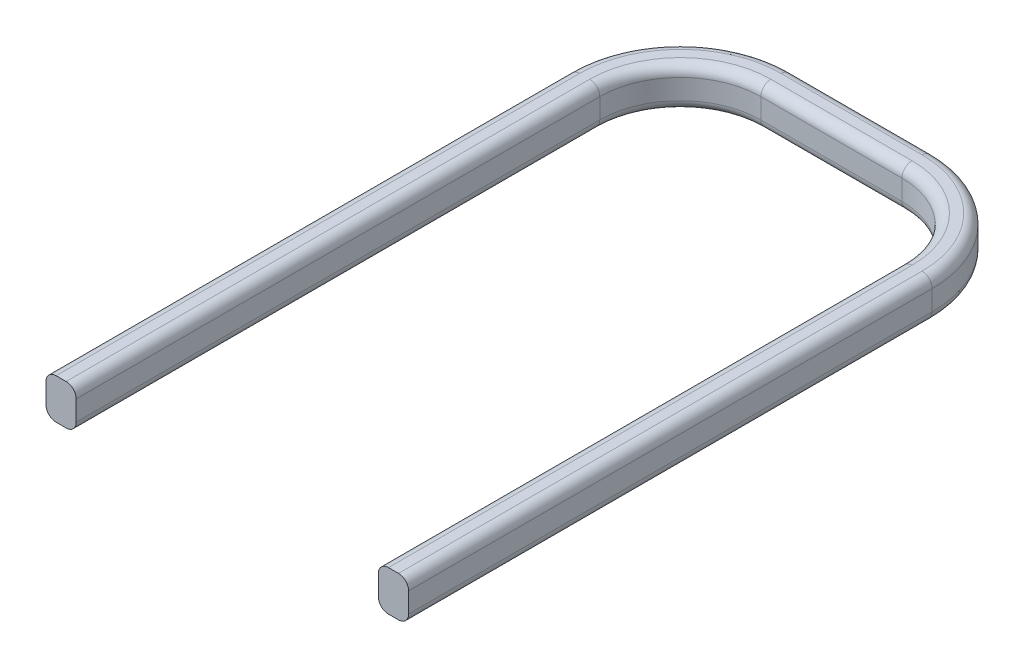
ISO-10303-21;
HEADER;
FILE_DESCRIPTION(('STEP AP214'),'2;1');
FILE_NAME('part.step','',(''),(''),'','','');
FILE_SCHEMA(('AUTOMOTIVE_DESIGN { 1 0 10303 214 1 1 1 1 }'));
ENDSEC;
DATA;
#1=APPLICATION_CONTEXT('core data for automotive mechanical design processes');
#2=APPLICATION_PROTOCOL_DEFINITION('international standard','automotive_design',2000,#1);
#3=PRODUCT_CONTEXT('',#1,'mechanical');
#4=PRODUCT('Part','Part','',(#3));
#5=PRODUCT_RELATED_PRODUCT_CATEGORY('part','',(#4));
#6=PRODUCT_DEFINITION_FORMATION('','',#4);
#7=PRODUCT_DEFINITION_CONTEXT('part definition',#1,'design');
#8=PRODUCT_DEFINITION('design','',#6,#7);
#9=PRODUCT_DEFINITION_SHAPE('','',#8);
#10=(LENGTH_UNIT() NAMED_UNIT(*) SI_UNIT(.MILLI.,.METRE.));
#11=(NAMED_UNIT(*) PLANE_ANGLE_UNIT() SI_UNIT($,.RADIAN.));
#12=(NAMED_UNIT(*) SI_UNIT($,.STERADIAN.) SOLID_ANGLE_UNIT());
#13=UNCERTAINTY_MEASURE_WITH_UNIT(LENGTH_MEASURE(1.E-05),#10,'distance_accuracy_value','');
#14=(GEOMETRIC_REPRESENTATION_CONTEXT(3) GLOBAL_UNCERTAINTY_ASSIGNED_CONTEXT((#13)) GLOBAL_UNIT_ASSIGNED_CONTEXT((#10,
#11,#12)) REPRESENTATION_CONTEXT('',''));
#15=CARTESIAN_POINT('',(0.,0.,0.));
#16=DIRECTION('',(0.,0.,1.));
#17=DIRECTION('',(1.,0.,0.));
#18=AXIS2_PLACEMENT_3D('',#15,#16,#17);
#19=CARTESIAN_POINT('',(4.30307838732567,0.,-13.));
#20=DIRECTION('',(-1.,0.,0.));
#21=DIRECTION('',(0.,0.,1.));
#22=AXIS2_PLACEMENT_3D('',#19,#20,#21);
#23=PLANE('',#22);
#24=DIRECTION('',(0.,-1.,0.));
#25=VECTOR('',#24,1.);
#26=CARTESIAN_POINT('',(4.30307838732567,0.,0.));
#27=LINE('',#26,#25);
#28=CARTESIAN_POINT('',(4.30307838732567,0.750000000000003,0.));
#29=VERTEX_POINT('',#28);
#30=CARTESIAN_POINT('',(4.30307838732567,0.250000000000001,0.));
#31=VERTEX_POINT('',#30);
#32=EDGE_CURVE('E398',#29,#31,#27,.T.);
#33=ORIENTED_EDGE('',*,*,#32,.T.);
#34=DIRECTION('',(0.,0.,1.));
#35=VECTOR('',#34,1.);
#36=CARTESIAN_POINT('',(4.30307838732567,0.250000000000001,-13.));
#37=LINE('',#36,#35);
#38=CARTESIAN_POINT('',(4.30307838732567,0.250000000000001,-13.));
#39=VERTEX_POINT('',#38);
#40=EDGE_CURVE('E244',#31,#39,#37,.F.);
#41=ORIENTED_EDGE('',*,*,#40,.T.);
#42=DIRECTION('',(0.,-1.,0.));
#43=VECTOR('',#42,1.);
#44=CARTESIAN_POINT('',(4.30307838732567,0.,-13.));
#45=LINE('',#44,#43);
#46=CARTESIAN_POINT('',(4.30307838732567,0.750000000000003,-13.));
#47=VERTEX_POINT('',#46);
#48=EDGE_CURVE('E390',#47,#39,#45,.T.);
#49=ORIENTED_EDGE('',*,*,#48,.F.);
#50=DIRECTION('',(0.,0.,1.));
#51=VECTOR('',#50,1.);
#52=CARTESIAN_POINT('',(4.30307838732567,0.750000000000003,0.));
#53=LINE('',#52,#51);
#54=EDGE_CURVE('E241',#47,#29,#53,.T.);
#55=ORIENTED_EDGE('',*,*,#54,.T.);
#56=EDGE_LOOP('',(#33,#41,#49,#55));
#57=FACE_BOUND('',#56,.T.);
#58=ADVANCED_FACE('F34',(#57),#23,.F.);
#59=CARTESIAN_POINT('',(3.55307838732567,0.,-13.));
#60=DIRECTION('',(1.,0.,0.));
#61=DIRECTION('',(0.,0.,-1.));
#62=AXIS2_PLACEMENT_3D('',#59,#60,#61);
#63=PLANE('',#62);
#64=DIRECTION('',(0.,1.,0.));
#65=VECTOR('',#64,1.);
#66=CARTESIAN_POINT('',(3.55307838732567,0.,-13.));
#67=LINE('',#66,#65);
#68=CARTESIAN_POINT('',(3.55307838732567,0.250000000000001,-13.));
#69=VERTEX_POINT('',#68);
#70=CARTESIAN_POINT('',(3.55307838732567,0.750000000000002,-13.));
#71=VERTEX_POINT('',#70);
#72=EDGE_CURVE('E387',#69,#71,#67,.T.);
#73=ORIENTED_EDGE('',*,*,#72,.F.);
#74=DIRECTION('',(0.,0.,1.));
#75=VECTOR('',#74,1.);
#76=CARTESIAN_POINT('',(3.55307838732567,0.250000000000001,0.));
#77=LINE('',#76,#75);
#78=CARTESIAN_POINT('',(3.55307838732567,0.250000000000001,0.));
#79=VERTEX_POINT('',#78);
#80=EDGE_CURVE('E260',#69,#79,#77,.T.);
#81=ORIENTED_EDGE('',*,*,#80,.T.);
#82=DIRECTION('',(0.,1.,0.));
#83=VECTOR('',#82,1.);
#84=CARTESIAN_POINT('',(3.55307838732567,0.,0.));
#85=LINE('',#84,#83);
#86=CARTESIAN_POINT('',(3.55307838732567,0.750000000000003,0.));
#87=VERTEX_POINT('',#86);
#88=EDGE_CURVE('E393',#79,#87,#85,.T.);
#89=ORIENTED_EDGE('',*,*,#88,.T.);
#90=DIRECTION('',(0.,0.,1.));
#91=VECTOR('',#90,1.);
#92=CARTESIAN_POINT('',(3.55307838732567,0.750000000000003,-13.));
#93=LINE('',#92,#91);
#94=EDGE_CURVE('E258',#87,#71,#93,.F.);
#95=ORIENTED_EDGE('',*,*,#94,.T.);
#96=EDGE_LOOP('',(#73,#81,#89,#95));
#97=FACE_BOUND('',#96,.T.);
#98=ADVANCED_FACE('F428',(#97),#63,.F.);
#99=CARTESIAN_POINT('',(1.55307838732567,0.,-13.));
#100=DIRECTION('',(0.,-1.,0.));
#101=DIRECTION('',(0.,0.,-1.));
#102=AXIS2_PLACEMENT_3D('',#99,#100,#101);
#103=CYLINDRICAL_SURFACE('',#102,2.75);
#104=ORIENTED_EDGE('',*,*,#48,.T.);
#105=CARTESIAN_POINT('',(1.55307838732567,0.250000000000001,-13.));
#106=DIRECTION('',(0.,-1.,0.));
#107=DIRECTION('',(1.,0.,0.));
#108=AXIS2_PLACEMENT_3D('',#105,#106,#107);
#109=CIRCLE('',#108,2.75);
#110=CARTESIAN_POINT('',(1.55307838732566,0.250000000000001,-15.75));
#111=VERTEX_POINT('',#110);
#112=EDGE_CURVE('E248',#39,#111,#109,.F.);
#113=ORIENTED_EDGE('',*,*,#112,.T.);
#114=DIRECTION('',(0.,-1.,0.));
#115=VECTOR('',#114,1.);
#116=CARTESIAN_POINT('',(1.55307838732566,0.,-15.75));
#117=LINE('',#116,#115);
#118=CARTESIAN_POINT('',(1.55307838732566,0.750000000000002,-15.75));
#119=VERTEX_POINT('',#118);
#120=EDGE_CURVE('E384',#119,#111,#117,.T.);
#121=ORIENTED_EDGE('',*,*,#120,.F.);
#122=CARTESIAN_POINT('',(1.55307838732567,0.750000000000002,-13.));
#123=DIRECTION('',(0.,1.,0.));
#124=DIRECTION('',(-1.,0.,0.));
#125=AXIS2_PLACEMENT_3D('',#122,#123,#124);
#126=CIRCLE('',#125,2.75);
#127=EDGE_CURVE('E246',#119,#47,#126,.F.);
#128=ORIENTED_EDGE('',*,*,#127,.T.);
#129=EDGE_LOOP('',(#104,#113,#121,#128));
#130=FACE_BOUND('',#129,.T.);
#131=ADVANCED_FACE('F512',(#130),#103,.T.);
#132=CARTESIAN_POINT('',(1.55307838732567,0.,-13.));
#133=DIRECTION('',(0.,-1.,0.));
#134=DIRECTION('',(0.,0.,-1.));
#135=AXIS2_PLACEMENT_3D('',#132,#133,#134);
#136=CYLINDRICAL_SURFACE('',#135,2.);
#137=DIRECTION('',(0.,1.,0.));
#138=VECTOR('',#137,1.);
#139=CARTESIAN_POINT('',(1.55307838732565,0.,-15.));
#140=LINE('',#139,#138);
#141=CARTESIAN_POINT('',(1.55307838732565,0.250000000000001,-15.));
#142=VERTEX_POINT('',#141);
#143=CARTESIAN_POINT('',(1.55307838732565,0.750000000000002,-15.));
#144=VERTEX_POINT('',#143);
#145=EDGE_CURVE('E381',#142,#144,#140,.T.);
#146=ORIENTED_EDGE('',*,*,#145,.F.);
#147=CARTESIAN_POINT('',(1.55307838732567,0.250000000000001,-13.));
#148=DIRECTION('',(0.,-1.,0.));
#149=DIRECTION('',(1.,0.,0.));
#150=AXIS2_PLACEMENT_3D('',#147,#148,#149);
#151=CIRCLE('',#150,2.);
#152=EDGE_CURVE('E265',#142,#69,#151,.T.);
#153=ORIENTED_EDGE('',*,*,#152,.T.);
#154=ORIENTED_EDGE('',*,*,#72,.T.);
#155=CARTESIAN_POINT('',(1.55307838732567,0.750000000000002,-13.));
#156=DIRECTION('',(0.,1.,0.));
#157=DIRECTION('',(-1.,0.,0.));
#158=AXIS2_PLACEMENT_3D('',#155,#156,#157);
#159=CIRCLE('',#158,2.);
#160=EDGE_CURVE('E263',#71,#144,#159,.T.);
#161=ORIENTED_EDGE('',*,*,#160,.T.);
#162=EDGE_LOOP('',(#146,#153,#154,#161));
#163=FACE_BOUND('',#162,.T.);
#164=ADVANCED_FACE('F425',(#163),#136,.F.);
#165=CARTESIAN_POINT('',(-1.94999999999998,0.,-15.75));
#166=DIRECTION('',(0.,0.,1.));
#167=DIRECTION('',(1.,0.,0.));
#168=AXIS2_PLACEMENT_3D('',#165,#166,#167);
#169=PLANE('',#168);
#170=ORIENTED_EDGE('',*,*,#120,.T.);
#171=DIRECTION('',(1.,0.,0.));
#172=VECTOR('',#171,1.);
#173=CARTESIAN_POINT('',(-1.94999999999998,0.25,-15.75));
#174=LINE('',#173,#172);
#175=CARTESIAN_POINT('',(-1.94999999999998,0.25,-15.75));
#176=VERTEX_POINT('',#175);
#177=EDGE_CURVE('E252',#111,#176,#174,.F.);
#178=ORIENTED_EDGE('',*,*,#177,.T.);
#179=DIRECTION('',(0.,-1.,0.));
#180=VECTOR('',#179,1.);
#181=CARTESIAN_POINT('',(-1.94999999999998,0.,-15.75));
#182=LINE('',#181,#180);
#183=CARTESIAN_POINT('',(-1.94999999999998,0.750000000000001,-15.75));
#184=VERTEX_POINT('',#183);
#185=EDGE_CURVE('E377',#184,#176,#182,.T.);
#186=ORIENTED_EDGE('',*,*,#185,.F.);
#187=DIRECTION('',(1.,0.,0.));
#188=VECTOR('',#187,1.);
#189=CARTESIAN_POINT('',(1.55307838732566,0.750000000000002,-15.75));
#190=LINE('',#189,#188);
#191=EDGE_CURVE('E250',#184,#119,#190,.T.);
#192=ORIENTED_EDGE('',*,*,#191,.T.);
#193=EDGE_LOOP('',(#170,#178,#186,#192));
#194=FACE_BOUND('',#193,.T.);
#195=ADVANCED_FACE('F553',(#194),#169,.F.);
#196=CARTESIAN_POINT('',(-1.94999999999999,0.,-15.));
#197=DIRECTION('',(0.,0.,-1.));
#198=DIRECTION('',(-1.,0.,0.));
#199=AXIS2_PLACEMENT_3D('',#196,#197,#198);
#200=PLANE('',#199);
#201=DIRECTION('',(0.,1.,0.));
#202=VECTOR('',#201,1.);
#203=CARTESIAN_POINT('',(-1.94999999999999,0.,-15.));
#204=LINE('',#203,#202);
#205=CARTESIAN_POINT('',(-1.94999999999999,0.25,-15.));
#206=VERTEX_POINT('',#205);
#207=CARTESIAN_POINT('',(-1.94999999999999,0.750000000000001,-15.));
#208=VERTEX_POINT('',#207);
#209=EDGE_CURVE('E374',#206,#208,#204,.T.);
#210=ORIENTED_EDGE('',*,*,#209,.F.);
#211=DIRECTION('',(1.,0.,0.));
#212=VECTOR('',#211,1.);
#213=CARTESIAN_POINT('',(1.55307838732565,0.250000000000001,-15.));
#214=LINE('',#213,#212);
#215=EDGE_CURVE('E269',#206,#142,#214,.T.);
#216=ORIENTED_EDGE('',*,*,#215,.T.);
#217=ORIENTED_EDGE('',*,*,#145,.T.);
#218=DIRECTION('',(1.,0.,0.));
#219=VECTOR('',#218,1.);
#220=CARTESIAN_POINT('',(-1.94999999999999,0.750000000000001,-15.));
#221=LINE('',#220,#219);
#222=EDGE_CURVE('E267',#144,#208,#221,.F.);
#223=ORIENTED_EDGE('',*,*,#222,.T.);
#224=EDGE_LOOP('',(#210,#216,#217,#223));
#225=FACE_BOUND('',#224,.T.);
#226=ADVANCED_FACE('F441',(#225),#200,.F.);
#227=CARTESIAN_POINT('',(-1.95,0.,-13.));
#228=DIRECTION('',(0.,-1.,0.));
#229=DIRECTION('',(0.,0.,-1.));
#230=AXIS2_PLACEMENT_3D('',#227,#228,#229);
#231=CYLINDRICAL_SURFACE('',#230,2.75);
#232=ORIENTED_EDGE('',*,*,#185,.T.);
#233=CARTESIAN_POINT('',(-1.95,0.25,-13.));
#234=DIRECTION('',(0.,-1.,0.));
#235=DIRECTION('',(1.,0.,0.));
#236=AXIS2_PLACEMENT_3D('',#233,#234,#235);
#237=CIRCLE('',#236,2.75);
#238=CARTESIAN_POINT('',(-4.7,0.25,-13.));
#239=VERTEX_POINT('',#238);
#240=EDGE_CURVE('E256',#176,#239,#237,.F.);
#241=ORIENTED_EDGE('',*,*,#240,.T.);
#242=DIRECTION('',(0.,-1.,0.));
#243=VECTOR('',#242,1.);
#244=CARTESIAN_POINT('',(-4.7,0.,-13.));
#245=LINE('',#244,#243);
#246=CARTESIAN_POINT('',(-4.7,0.75,-13.));
#247=VERTEX_POINT('',#246);
#248=EDGE_CURVE('E378',#247,#239,#245,.T.);
#249=ORIENTED_EDGE('',*,*,#248,.F.);
#250=CARTESIAN_POINT('',(-1.95,0.750000000000001,-13.));
#251=DIRECTION('',(0.,1.,0.));
#252=DIRECTION('',(-1.,0.,0.));
#253=AXIS2_PLACEMENT_3D('',#250,#251,#252);
#254=CIRCLE('',#253,2.75);
#255=EDGE_CURVE('E254',#247,#184,#254,.F.);
#256=ORIENTED_EDGE('',*,*,#255,.T.);
#257=EDGE_LOOP('',(#232,#241,#249,#256));
#258=FACE_BOUND('',#257,.T.);
#259=ADVANCED_FACE('F546',(#258),#231,.T.);
#260=CARTESIAN_POINT('',(-1.95,0.,-13.));
#261=DIRECTION('',(0.,-1.,0.));
#262=DIRECTION('',(0.,0.,-1.));
#263=AXIS2_PLACEMENT_3D('',#260,#261,#262);
#264=CYLINDRICAL_SURFACE('',#263,2.);
#265=DIRECTION('',(0.,1.,0.));
#266=VECTOR('',#265,1.);
#267=CARTESIAN_POINT('',(-3.95,0.,-13.));
#268=LINE('',#267,#266);
#269=CARTESIAN_POINT('',(-3.95,0.25,-13.));
#270=VERTEX_POINT('',#269);
#271=CARTESIAN_POINT('',(-3.95,0.75,-13.));
#272=VERTEX_POINT('',#271);
#273=EDGE_CURVE('E212',#270,#272,#268,.T.);
#274=ORIENTED_EDGE('',*,*,#273,.F.);
#275=CARTESIAN_POINT('',(-1.95,0.25,-13.));
#276=DIRECTION('',(0.,-1.,0.));
#277=DIRECTION('',(1.,0.,0.));
#278=AXIS2_PLACEMENT_3D('',#275,#276,#277);
#279=CIRCLE('',#278,2.);
#280=EDGE_CURVE('E273',#270,#206,#279,.T.);
#281=ORIENTED_EDGE('',*,*,#280,.T.);
#282=ORIENTED_EDGE('',*,*,#209,.T.);
#283=CARTESIAN_POINT('',(-1.95,0.750000000000001,-13.));
#284=DIRECTION('',(0.,1.,0.));
#285=DIRECTION('',(-1.,0.,0.));
#286=AXIS2_PLACEMENT_3D('',#283,#284,#285);
#287=CIRCLE('',#286,2.);
#288=EDGE_CURVE('E271',#208,#272,#287,.T.);
#289=ORIENTED_EDGE('',*,*,#288,.T.);
#290=EDGE_LOOP('',(#274,#281,#282,#289));
#291=FACE_BOUND('',#290,.T.);
#292=ADVANCED_FACE('F543',(#291),#264,.F.);
#293=CARTESIAN_POINT('',(-3.95,0.,-13.));
#294=DIRECTION('',(1.,0.,0.));
#295=DIRECTION('',(0.,0.,-1.));
#296=AXIS2_PLACEMENT_3D('',#293,#294,#295);
#297=PLANE('',#296);
#298=DIRECTION('',(0.,1.,0.));
#299=VECTOR('',#298,1.);
#300=CARTESIAN_POINT('',(-3.95,0.,0.));
#301=LINE('',#300,#299);
#302=CARTESIAN_POINT('',(-3.95,0.25,0.));
#303=VERTEX_POINT('',#302);
#304=CARTESIAN_POINT('',(-3.95,0.75,0.));
#305=VERTEX_POINT('',#304);
#306=EDGE_CURVE('E317',#303,#305,#301,.T.);
#307=ORIENTED_EDGE('',*,*,#306,.F.);
#308=DIRECTION('',(0.,0.,1.));
#309=VECTOR('',#308,1.);
#310=CARTESIAN_POINT('',(-3.95,0.25,-13.));
#311=LINE('',#310,#309);
#312=EDGE_CURVE('E11',#303,#270,#311,.F.);
#313=ORIENTED_EDGE('',*,*,#312,.T.);
#314=ORIENTED_EDGE('',*,*,#273,.T.);
#315=DIRECTION('',(0.,0.,1.));
#316=VECTOR('',#315,1.);
#317=CARTESIAN_POINT('',(-3.95,0.75,-13.));
#318=LINE('',#317,#316);
#319=EDGE_CURVE('E43',#272,#305,#318,.T.);
#320=ORIENTED_EDGE('',*,*,#319,.T.);
#321=EDGE_LOOP('',(#307,#313,#314,#320));
#322=FACE_BOUND('',#321,.T.);
#323=ADVANCED_FACE('F536',(#322),#297,.T.);
#324=CARTESIAN_POINT('',(-3.95,0.,-13.));
#325=DIRECTION('',(0.,-1.,0.));
#326=DIRECTION('',(1.,0.,0.));
#327=AXIS2_PLACEMENT_3D('',#324,#325,#326);
#328=PLANE('',#327);
#329=CARTESIAN_POINT('',(1.55307838732567,0.,-13.));
#330=DIRECTION('',(0.,-1.,0.));
#331=DIRECTION('',(1.,0.,0.));
#332=AXIS2_PLACEMENT_3D('',#329,#330,#331);
#333=CIRCLE('',#332,2.5);
#334=CARTESIAN_POINT('',(1.55307838732567,0.,-15.5));
#335=VERTEX_POINT('',#334);
#336=CARTESIAN_POINT('',(4.05307838732567,0.,-13.));
#337=VERTEX_POINT('',#336);
#338=EDGE_CURVE('E228',#335,#337,#333,.T.);
#339=ORIENTED_EDGE('',*,*,#338,.T.);
#340=DIRECTION('',(0.,0.,1.));
#341=VECTOR('',#340,1.);
#342=CARTESIAN_POINT('',(4.05307838732567,0.,0.));
#343=LINE('',#342,#341);
#344=CARTESIAN_POINT('',(4.05307838732567,0.,0.));
#345=VERTEX_POINT('',#344);
#346=EDGE_CURVE('E230',#337,#345,#343,.T.);
#347=ORIENTED_EDGE('',*,*,#346,.T.);
#348=DIRECTION('',(-1.,0.,0.));
#349=VECTOR('',#348,1.);
#350=CARTESIAN_POINT('',(3.55307838732567,0.,0.));
#351=LINE('',#350,#349);
#352=CARTESIAN_POINT('',(3.80307838732567,0.,0.));
#353=VERTEX_POINT('',#352);
#354=EDGE_CURVE('E401',#345,#353,#351,.T.);
#355=ORIENTED_EDGE('',*,*,#354,.T.);
#356=DIRECTION('',(0.,0.,1.));
#357=VECTOR('',#356,1.);
#358=CARTESIAN_POINT('',(3.80307838732567,0.,-13.));
#359=LINE('',#358,#357);
#360=CARTESIAN_POINT('',(3.80307838732567,0.,-13.));
#361=VERTEX_POINT('',#360);
#362=EDGE_CURVE('E219',#353,#361,#359,.F.);
#363=ORIENTED_EDGE('',*,*,#362,.T.);
#364=CARTESIAN_POINT('',(1.55307838732567,0.,-13.));
#365=DIRECTION('',(0.,-1.,0.));
#366=DIRECTION('',(1.,0.,0.));
#367=AXIS2_PLACEMENT_3D('',#364,#365,#366);
#368=CIRCLE('',#367,2.25);
#369=CARTESIAN_POINT('',(1.55307838732565,0.,-15.25));
#370=VERTEX_POINT('',#369);
#371=EDGE_CURVE('E223',#361,#370,#368,.F.);
#372=ORIENTED_EDGE('',*,*,#371,.T.);
#373=DIRECTION('',(1.,0.,0.));
#374=VECTOR('',#373,1.);
#375=CARTESIAN_POINT('',(-1.94999999999999,0.,-15.25));
#376=LINE('',#375,#374);
#377=CARTESIAN_POINT('',(-1.94999999999999,0.,-15.25));
#378=VERTEX_POINT('',#377);
#379=EDGE_CURVE('E407',#370,#378,#376,.F.);
#380=ORIENTED_EDGE('',*,*,#379,.T.);
#381=CARTESIAN_POINT('',(-1.95,0.,-13.));
#382=DIRECTION('',(0.,-1.,0.));
#383=DIRECTION('',(1.,0.,0.));
#384=AXIS2_PLACEMENT_3D('',#381,#382,#383);
#385=CIRCLE('',#384,2.25);
#386=CARTESIAN_POINT('',(-4.2,0.,-13.));
#387=VERTEX_POINT('',#386);
#388=EDGE_CURVE('E405',#378,#387,#385,.F.);
#389=ORIENTED_EDGE('',*,*,#388,.T.);
#390=DIRECTION('',(0.,0.,1.));
#391=VECTOR('',#390,1.);
#392=CARTESIAN_POINT('',(-4.2,0.,-13.));
#393=LINE('',#392,#391);
#394=CARTESIAN_POINT('',(-4.2,0.,0.));
#395=VERTEX_POINT('',#394);
#396=EDGE_CURVE('E211',#387,#395,#393,.T.);
#397=ORIENTED_EDGE('',*,*,#396,.T.);
#398=DIRECTION('',(1.,0.,0.));
#399=VECTOR('',#398,1.);
#400=CARTESIAN_POINT('',(-3.95,0.,0.));
#401=LINE('',#400,#399);
#402=CARTESIAN_POINT('',(-4.45,0.,0.));
#403=VERTEX_POINT('',#402);
#404=EDGE_CURVE('E199',#403,#395,#401,.T.);
#405=ORIENTED_EDGE('',*,*,#404,.F.);
#406=DIRECTION('',(0.,0.,1.));
#407=VECTOR('',#406,1.);
#408=CARTESIAN_POINT('',(-4.45,0.,-13.));
#409=LINE('',#408,#407);
#410=CARTESIAN_POINT('',(-4.45,0.,-13.));
#411=VERTEX_POINT('',#410);
#412=EDGE_CURVE('E208',#403,#411,#409,.F.);
#413=ORIENTED_EDGE('',*,*,#412,.T.);
#414=CARTESIAN_POINT('',(-1.95,0.,-13.));
#415=DIRECTION('',(0.,-1.,0.));
#416=DIRECTION('',(1.,0.,0.));
#417=AXIS2_PLACEMENT_3D('',#414,#415,#416);
#418=CIRCLE('',#417,2.5);
#419=CARTESIAN_POINT('',(-1.94999999999998,0.,-15.5));
#420=VERTEX_POINT('',#419);
#421=EDGE_CURVE('E218',#411,#420,#418,.T.);
#422=ORIENTED_EDGE('',*,*,#421,.T.);
#423=DIRECTION('',(1.,0.,0.));
#424=VECTOR('',#423,1.);
#425=CARTESIAN_POINT('',(1.55307838732566,0.,-15.5));
#426=LINE('',#425,#424);
#427=EDGE_CURVE('E221',#420,#335,#426,.T.);
#428=ORIENTED_EDGE('',*,*,#427,.T.);
#429=EDGE_LOOP('',(#339,#347,#355,#363,#372,#380,#389,#397,#405,#413,#422,#428));
#430=FACE_BOUND('',#429,.T.);
#431=ADVANCED_FACE('F207',(#430),#328,.T.);
#432=CARTESIAN_POINT('',(-4.7,0.,-13.));
#433=DIRECTION('',(-1.,0.,0.));
#434=DIRECTION('',(0.,0.,1.));
#435=AXIS2_PLACEMENT_3D('',#432,#433,#434);
#436=PLANE('',#435);
#437=ORIENTED_EDGE('',*,*,#248,.T.);
#438=DIRECTION('',(0.,0.,1.));
#439=VECTOR('',#438,1.);
#440=CARTESIAN_POINT('',(-4.7,0.25,-13.));
#441=LINE('',#440,#439);
#442=CARTESIAN_POINT('',(-4.7,0.25,0.));
#443=VERTEX_POINT('',#442);
#444=EDGE_CURVE('E298',#239,#443,#441,.T.);
#445=ORIENTED_EDGE('',*,*,#444,.T.);
#446=DIRECTION('',(0.,-1.,0.));
#447=VECTOR('',#446,1.);
#448=CARTESIAN_POINT('',(-4.7,0.,0.));
#449=LINE('',#448,#447);
#450=CARTESIAN_POINT('',(-4.7,0.75,0.));
#451=VERTEX_POINT('',#450);
#452=EDGE_CURVE('E201',#451,#443,#449,.T.);
#453=ORIENTED_EDGE('',*,*,#452,.F.);
#454=DIRECTION('',(0.,0.,1.));
#455=VECTOR('',#454,1.);
#456=CARTESIAN_POINT('',(-4.7,0.75,-13.));
#457=LINE('',#456,#455);
#458=EDGE_CURVE('E296',#451,#247,#457,.F.);
#459=ORIENTED_EDGE('',*,*,#458,.T.);
#460=EDGE_LOOP('',(#437,#445,#453,#459));
#461=FACE_BOUND('',#460,.T.);
#462=ADVANCED_FACE('F478',(#461),#436,.T.);
#463=CARTESIAN_POINT('',(-3.95,1.,-13.));
#464=DIRECTION('',(0.,1.,0.));
#465=DIRECTION('',(-1.,0.,0.));
#466=AXIS2_PLACEMENT_3D('',#463,#464,#465);
#467=PLANE('',#466);
#468=DIRECTION('',(1.,0.,0.));
#469=VECTOR('',#468,1.);
#470=CARTESIAN_POINT('',(3.55307838732567,1.,0.));
#471=LINE('',#470,#469);
#472=CARTESIAN_POINT('',(3.80307838732567,1.,0.));
#473=VERTEX_POINT('',#472);
#474=CARTESIAN_POINT('',(4.05307838732567,1.,0.));
#475=VERTEX_POINT('',#474);
#476=EDGE_CURVE('E396',#473,#475,#471,.T.);
#477=ORIENTED_EDGE('',*,*,#476,.T.);
#478=DIRECTION('',(0.,0.,1.));
#479=VECTOR('',#478,1.);
#480=CARTESIAN_POINT('',(4.05307838732567,1.,-13.));
#481=LINE('',#480,#479);
#482=CARTESIAN_POINT('',(4.05307838732567,1.,-13.));
#483=VERTEX_POINT('',#482);
#484=EDGE_CURVE('E294',#475,#483,#481,.F.);
#485=ORIENTED_EDGE('',*,*,#484,.T.);
#486=CARTESIAN_POINT('',(1.55307838732567,1.,-13.));
#487=DIRECTION('',(0.,1.,0.));
#488=DIRECTION('',(-1.,0.,0.));
#489=AXIS2_PLACEMENT_3D('',#486,#487,#488);
#490=CIRCLE('',#489,2.5);
#491=CARTESIAN_POINT('',(1.55307838732567,1.,-15.5));
#492=VERTEX_POINT('',#491);
#493=EDGE_CURVE('E292',#483,#492,#490,.T.);
#494=ORIENTED_EDGE('',*,*,#493,.T.);
#495=DIRECTION('',(1.,0.,0.));
#496=VECTOR('',#495,1.);
#497=CARTESIAN_POINT('',(-1.94999999999998,1.,-15.5));
#498=LINE('',#497,#496);
#499=CARTESIAN_POINT('',(-1.94999999999998,1.,-15.5));
#500=VERTEX_POINT('',#499);
#501=EDGE_CURVE('E290',#492,#500,#498,.F.);
#502=ORIENTED_EDGE('',*,*,#501,.T.);
#503=CARTESIAN_POINT('',(-1.95,1.,-13.));
#504=DIRECTION('',(0.,1.,0.));
#505=DIRECTION('',(-1.,0.,0.));
#506=AXIS2_PLACEMENT_3D('',#503,#504,#505);
#507=CIRCLE('',#506,2.5);
#508=CARTESIAN_POINT('',(-4.45,1.,-13.));
#509=VERTEX_POINT('',#508);
#510=EDGE_CURVE('E288',#500,#509,#507,.T.);
#511=ORIENTED_EDGE('',*,*,#510,.T.);
#512=DIRECTION('',(0.,0.,1.));
#513=VECTOR('',#512,1.);
#514=CARTESIAN_POINT('',(-4.45,1.,-13.));
#515=LINE('',#514,#513);
#516=CARTESIAN_POINT('',(-4.45,1.,0.));
#517=VERTEX_POINT('',#516);
#518=EDGE_CURVE('E286',#509,#517,#515,.T.);
#519=ORIENTED_EDGE('',*,*,#518,.T.);
#520=DIRECTION('',(-1.,0.,0.));
#521=VECTOR('',#520,1.);
#522=CARTESIAN_POINT('',(-3.95,1.,0.));
#523=LINE('',#522,#521);
#524=CARTESIAN_POINT('',(-4.2,1.,0.));
#525=VERTEX_POINT('',#524);
#526=EDGE_CURVE('E363',#525,#517,#523,.T.);
#527=ORIENTED_EDGE('',*,*,#526,.F.);
#528=DIRECTION('',(0.,0.,1.));
#529=VECTOR('',#528,1.);
#530=CARTESIAN_POINT('',(-4.2,1.,-13.));
#531=LINE('',#530,#529);
#532=CARTESIAN_POINT('',(-4.2,1.,-13.));
#533=VERTEX_POINT('',#532);
#534=EDGE_CURVE('E275',#525,#533,#531,.F.);
#535=ORIENTED_EDGE('',*,*,#534,.T.);
#536=CARTESIAN_POINT('',(-1.95,1.,-13.));
#537=DIRECTION('',(0.,1.,0.));
#538=DIRECTION('',(-1.,0.,0.));
#539=AXIS2_PLACEMENT_3D('',#536,#537,#538);
#540=CIRCLE('',#539,2.25);
#541=CARTESIAN_POINT('',(-1.94999999999999,1.,-15.25));
#542=VERTEX_POINT('',#541);
#543=EDGE_CURVE('E277',#533,#542,#540,.F.);
#544=ORIENTED_EDGE('',*,*,#543,.T.);
#545=DIRECTION('',(1.,0.,0.));
#546=VECTOR('',#545,1.);
#547=CARTESIAN_POINT('',(1.55307838732565,1.,-15.25));
#548=LINE('',#547,#546);
#549=CARTESIAN_POINT('',(1.55307838732565,1.,-15.25));
#550=VERTEX_POINT('',#549);
#551=EDGE_CURVE('E279',#542,#550,#548,.T.);
#552=ORIENTED_EDGE('',*,*,#551,.T.);
#553=CARTESIAN_POINT('',(1.55307838732567,1.,-13.));
#554=DIRECTION('',(0.,1.,0.));
#555=DIRECTION('',(-1.,0.,0.));
#556=AXIS2_PLACEMENT_3D('',#553,#554,#555);
#557=CIRCLE('',#556,2.25);
#558=CARTESIAN_POINT('',(3.80307838732567,1.,-13.));
#559=VERTEX_POINT('',#558);
#560=EDGE_CURVE('E281',#550,#559,#557,.F.);
#561=ORIENTED_EDGE('',*,*,#560,.T.);
#562=DIRECTION('',(0.,0.,1.));
#563=VECTOR('',#562,1.);
#564=CARTESIAN_POINT('',(3.80307838732567,1.,0.));
#565=LINE('',#564,#563);
#566=EDGE_CURVE('E283',#559,#473,#565,.T.);
#567=ORIENTED_EDGE('',*,*,#566,.T.);
#568=EDGE_LOOP('',(#477,#485,#494,#502,#511,#519,#527,#535,#544,#552,#561,#567));
#569=FACE_BOUND('',#568,.T.);
#570=ADVANCED_FACE('F367',(#569),#467,.T.);
#571=CARTESIAN_POINT('',(-0.396921612674331,0.,-1.11022302462516E-13));
#572=DIRECTION('',(0.,0.,-1.));
#573=DIRECTION('',(-1.,0.,0.));
#574=AXIS2_PLACEMENT_3D('',#571,#572,#573);
#575=PLANE('',#574);
#576=ORIENTED_EDGE('',*,*,#354,.F.);
#577=CARTESIAN_POINT('',(4.05307838732567,0.250000000000001,0.));
#578=DIRECTION('',(0.,0.,-1.));
#579=DIRECTION('',(-1.,0.,0.));
#580=AXIS2_PLACEMENT_3D('',#577,#578,#579);
#581=CIRCLE('',#580,0.25);
#582=EDGE_CURVE('E239',#345,#31,#581,.F.);
#583=ORIENTED_EDGE('',*,*,#582,.T.);
#584=ORIENTED_EDGE('',*,*,#32,.F.);
#585=CARTESIAN_POINT('',(4.05307838732567,0.750000000000003,0.));
#586=DIRECTION('',(0.,0.,-1.));
#587=DIRECTION('',(-1.,0.,0.));
#588=AXIS2_PLACEMENT_3D('',#585,#586,#587);
#589=CIRCLE('',#588,0.25);
#590=EDGE_CURVE('E235',#29,#475,#589,.F.);
#591=ORIENTED_EDGE('',*,*,#590,.T.);
#592=ORIENTED_EDGE('',*,*,#476,.F.);
#593=CARTESIAN_POINT('',(3.80307838732567,0.750000000000003,0.));
#594=DIRECTION('',(0.,0.,-1.));
#595=DIRECTION('',(-1.,0.,0.));
#596=AXIS2_PLACEMENT_3D('',#593,#594,#595);
#597=CIRCLE('',#596,0.25);
#598=EDGE_CURVE('E233',#473,#87,#597,.F.);
#599=ORIENTED_EDGE('',*,*,#598,.T.);
#600=ORIENTED_EDGE('',*,*,#88,.F.);
#601=CARTESIAN_POINT('',(3.80307838732567,0.250000000000001,0.));
#602=DIRECTION('',(0.,0.,-1.));
#603=DIRECTION('',(-1.,0.,0.));
#604=AXIS2_PLACEMENT_3D('',#601,#602,#603);
#605=CIRCLE('',#604,0.25);
#606=EDGE_CURVE('E237',#79,#353,#605,.F.);
#607=ORIENTED_EDGE('',*,*,#606,.T.);
#608=EDGE_LOOP('',(#576,#583,#584,#591,#592,#599,#600,#607));
#609=FACE_BOUND('',#608,.T.);
#610=ADVANCED_FACE('F447',(#609),#575,.F.);
#611=CARTESIAN_POINT('',(0.,0.,0.));
#612=DIRECTION('',(0.,0.,1.));
#613=DIRECTION('',(1.,0.,0.));
#614=AXIS2_PLACEMENT_3D('',#611,#612,#613);
#615=PLANE('',#614);
#616=ORIENTED_EDGE('',*,*,#452,.T.);
#617=CARTESIAN_POINT('',(-4.45,0.25,0.));
#618=DIRECTION('',(0.,0.,1.));
#619=DIRECTION('',(1.,0.,0.));
#620=AXIS2_PLACEMENT_3D('',#617,#618,#619);
#621=CIRCLE('',#620,0.25);
#622=EDGE_CURVE('E196',#443,#403,#621,.T.);
#623=ORIENTED_EDGE('',*,*,#622,.T.);
#624=ORIENTED_EDGE('',*,*,#404,.T.);
#625=CARTESIAN_POINT('',(-4.2,0.25,0.));
#626=DIRECTION('',(0.,0.,1.));
#627=DIRECTION('',(1.,0.,0.));
#628=AXIS2_PLACEMENT_3D('',#625,#626,#627);
#629=CIRCLE('',#628,0.25);
#630=EDGE_CURVE('E57',#395,#303,#629,.T.);
#631=ORIENTED_EDGE('',*,*,#630,.T.);
#632=ORIENTED_EDGE('',*,*,#306,.T.);
#633=CARTESIAN_POINT('',(-4.2,0.75,0.));
#634=DIRECTION('',(0.,0.,1.));
#635=DIRECTION('',(1.,0.,0.));
#636=AXIS2_PLACEMENT_3D('',#633,#634,#635);
#637=CIRCLE('',#636,0.25);
#638=EDGE_CURVE('E300',#305,#525,#637,.T.);
#639=ORIENTED_EDGE('',*,*,#638,.T.);
#640=ORIENTED_EDGE('',*,*,#526,.T.);
#641=CARTESIAN_POINT('',(-4.45,0.75,0.));
#642=DIRECTION('',(0.,0.,1.));
#643=DIRECTION('',(1.,0.,0.));
#644=AXIS2_PLACEMENT_3D('',#641,#642,#643);
#645=CIRCLE('',#644,0.25);
#646=EDGE_CURVE('E302',#517,#451,#645,.T.);
#647=ORIENTED_EDGE('',*,*,#646,.T.);
#648=EDGE_LOOP('',(#616,#623,#624,#631,#632,#639,#640,#647));
#649=FACE_BOUND('',#648,.T.);
#650=ADVANCED_FACE('F198',(#649),#615,.T.);
#651=CARTESIAN_POINT('',(-4.45,0.25,-13.));
#652=DIRECTION('',(0.,0.,1.));
#653=DIRECTION('',(1.,0.,0.));
#654=AXIS2_PLACEMENT_3D('',#651,#652,#653);
#655=CYLINDRICAL_SURFACE('',#654,0.25);
#656=ORIENTED_EDGE('',*,*,#622,.F.);
#657=ORIENTED_EDGE('',*,*,#444,.F.);
#658=CARTESIAN_POINT('',(-4.45,0.25,-13.));
#659=DIRECTION('',(0.,0.,-1.));
#660=DIRECTION('',(-1.,0.,0.));
#661=AXIS2_PLACEMENT_3D('',#658,#659,#660);
#662=CIRCLE('',#661,0.25);
#663=EDGE_CURVE('E216',#411,#239,#662,.T.);
#664=ORIENTED_EDGE('',*,*,#663,.F.);
#665=ORIENTED_EDGE('',*,*,#412,.F.);
#666=EDGE_LOOP('',(#656,#657,#664,#665));
#667=FACE_BOUND('',#666,.T.);
#668=ADVANCED_FACE('F214',(#667),#655,.T.);
#669=CARTESIAN_POINT('',(-1.95,0.25,-13.));
#670=DIRECTION('',(0.,-1.,0.));
#671=DIRECTION('',(1.,0.,0.));
#672=AXIS2_PLACEMENT_3D('',#669,#670,#671);
#673=TOROIDAL_SURFACE('',#672,2.5,0.25);
#674=ORIENTED_EDGE('',*,*,#663,.T.);
#675=ORIENTED_EDGE('',*,*,#240,.F.);
#676=CARTESIAN_POINT('',(-1.94999999999998,0.25,-15.5));
#677=DIRECTION('',(1.,0.,0.));
#678=DIRECTION('',(0.,0.,-1.));
#679=AXIS2_PLACEMENT_3D('',#676,#677,#678);
#680=CIRCLE('',#679,0.25);
#681=EDGE_CURVE('E313',#420,#176,#680,.T.);
#682=ORIENTED_EDGE('',*,*,#681,.F.);
#683=ORIENTED_EDGE('',*,*,#421,.F.);
#684=EDGE_LOOP('',(#674,#675,#682,#683));
#685=FACE_BOUND('',#684,.T.);
#686=ADVANCED_FACE('F482',(#685),#673,.T.);
#687=CARTESIAN_POINT('',(-3.95,0.25,-15.5));
#688=DIRECTION('',(-1.,0.,0.));
#689=DIRECTION('',(0.,-1.,0.));
#690=AXIS2_PLACEMENT_3D('',#687,#688,#689);
#691=CYLINDRICAL_SURFACE('',#690,0.25);
#692=ORIENTED_EDGE('',*,*,#681,.T.);
#693=ORIENTED_EDGE('',*,*,#177,.F.);
#694=CARTESIAN_POINT('',(1.55307838732567,0.250000000000001,-15.5));
#695=DIRECTION('',(1.,0.,0.));
#696=DIRECTION('',(0.,0.,-1.));
#697=AXIS2_PLACEMENT_3D('',#694,#695,#696);
#698=CIRCLE('',#697,0.25);
#699=EDGE_CURVE('E309',#335,#111,#698,.T.);
#700=ORIENTED_EDGE('',*,*,#699,.F.);
#701=ORIENTED_EDGE('',*,*,#427,.F.);
#702=EDGE_LOOP('',(#692,#693,#700,#701));
#703=FACE_BOUND('',#702,.T.);
#704=ADVANCED_FACE('F490',(#703),#691,.T.);
#705=CARTESIAN_POINT('',(1.55307838732567,0.250000000000001,-13.));
#706=DIRECTION('',(0.,-1.,0.));
#707=DIRECTION('',(1.,0.,0.));
#708=AXIS2_PLACEMENT_3D('',#705,#706,#707);
#709=TOROIDAL_SURFACE('',#708,2.5,0.25);
#710=ORIENTED_EDGE('',*,*,#699,.T.);
#711=ORIENTED_EDGE('',*,*,#112,.F.);
#712=CARTESIAN_POINT('',(4.05307838732567,0.250000000000001,-13.));
#713=DIRECTION('',(0.,0.,1.));
#714=DIRECTION('',(1.,0.,0.));
#715=AXIS2_PLACEMENT_3D('',#712,#713,#714);
#716=CIRCLE('',#715,0.25);
#717=EDGE_CURVE('E306',#337,#39,#716,.T.);
#718=ORIENTED_EDGE('',*,*,#717,.F.);
#719=ORIENTED_EDGE('',*,*,#338,.F.);
#720=EDGE_LOOP('',(#710,#711,#718,#719));
#721=FACE_BOUND('',#720,.T.);
#722=ADVANCED_FACE('F492',(#721),#709,.T.);
#723=CARTESIAN_POINT('',(4.05307838732567,0.250000000000001,-13.));
#724=DIRECTION('',(0.,0.,-1.));
#725=DIRECTION('',(-1.,0.,0.));
#726=AXIS2_PLACEMENT_3D('',#723,#724,#725);
#727=CYLINDRICAL_SURFACE('',#726,0.25);
#728=ORIENTED_EDGE('',*,*,#717,.T.);
#729=ORIENTED_EDGE('',*,*,#40,.F.);
#730=ORIENTED_EDGE('',*,*,#582,.F.);
#731=ORIENTED_EDGE('',*,*,#346,.F.);
#732=EDGE_LOOP('',(#728,#729,#730,#731));
#733=FACE_BOUND('',#732,.T.);
#734=ADVANCED_FACE('F495',(#733),#727,.T.);
#735=CARTESIAN_POINT('',(-4.2,0.25,-13.));
#736=DIRECTION('',(0.,0.,1.));
#737=DIRECTION('',(1.,0.,0.));
#738=AXIS2_PLACEMENT_3D('',#735,#736,#737);
#739=CYLINDRICAL_SURFACE('',#738,0.25);
#740=ORIENTED_EDGE('',*,*,#630,.F.);
#741=ORIENTED_EDGE('',*,*,#396,.F.);
#742=CARTESIAN_POINT('',(-4.2,0.25,-13.));
#743=DIRECTION('',(0.,0.,-1.));
#744=DIRECTION('',(0.,1.,0.));
#745=AXIS2_PLACEMENT_3D('',#742,#743,#744);
#746=CIRCLE('',#745,0.25);
#747=EDGE_CURVE('E310',#270,#387,#746,.T.);
#748=ORIENTED_EDGE('',*,*,#747,.F.);
#749=ORIENTED_EDGE('',*,*,#312,.F.);
#750=EDGE_LOOP('',(#740,#741,#748,#749));
#751=FACE_BOUND('',#750,.T.);
#752=ADVANCED_FACE('F518',(#751),#739,.T.);
#753=CARTESIAN_POINT('',(-1.95,0.25,-13.));
#754=DIRECTION('',(0.,-1.,0.));
#755=DIRECTION('',(1.,0.,0.));
#756=AXIS2_PLACEMENT_3D('',#753,#754,#755);
#757=TOROIDAL_SURFACE('',#756,2.25,0.25);
#758=ORIENTED_EDGE('',*,*,#747,.T.);
#759=ORIENTED_EDGE('',*,*,#388,.F.);
#760=CARTESIAN_POINT('',(-1.94999999999998,0.25,-15.25));
#761=DIRECTION('',(1.,0.,0.));
#762=DIRECTION('',(0.,1.,0.));
#763=AXIS2_PLACEMENT_3D('',#760,#761,#762);
#764=CIRCLE('',#763,0.25);
#765=EDGE_CURVE('E325',#206,#378,#764,.T.);
#766=ORIENTED_EDGE('',*,*,#765,.F.);
#767=ORIENTED_EDGE('',*,*,#280,.F.);
#768=EDGE_LOOP('',(#758,#759,#766,#767));
#769=FACE_BOUND('',#768,.T.);
#770=ADVANCED_FACE('F644',(#769),#757,.T.);
#771=CARTESIAN_POINT('',(-1.94999999999999,0.25,-15.25));
#772=DIRECTION('',(-1.,0.,0.));
#773=DIRECTION('',(0.,-1.,0.));
#774=AXIS2_PLACEMENT_3D('',#771,#772,#773);
#775=CYLINDRICAL_SURFACE('',#774,0.25);
#776=ORIENTED_EDGE('',*,*,#765,.T.);
#777=ORIENTED_EDGE('',*,*,#379,.F.);
#778=CARTESIAN_POINT('',(1.55307838732565,0.250000000000001,-15.25));
#779=DIRECTION('',(1.,0.,0.));
#780=DIRECTION('',(0.,1.,0.));
#781=AXIS2_PLACEMENT_3D('',#778,#779,#780);
#782=CIRCLE('',#781,0.25);
#783=EDGE_CURVE('E321',#142,#370,#782,.T.);
#784=ORIENTED_EDGE('',*,*,#783,.F.);
#785=ORIENTED_EDGE('',*,*,#215,.F.);
#786=EDGE_LOOP('',(#776,#777,#784,#785));
#787=FACE_BOUND('',#786,.T.);
#788=ADVANCED_FACE('F416',(#787),#775,.T.);
#789=CARTESIAN_POINT('',(1.55307838732567,0.250000000000001,-13.));
#790=DIRECTION('',(0.,-1.,0.));
#791=DIRECTION('',(1.,0.,0.));
#792=AXIS2_PLACEMENT_3D('',#789,#790,#791);
#793=TOROIDAL_SURFACE('',#792,2.25,0.25);
#794=ORIENTED_EDGE('',*,*,#783,.T.);
#795=ORIENTED_EDGE('',*,*,#371,.F.);
#796=CARTESIAN_POINT('',(3.80307838732567,0.250000000000001,-13.));
#797=DIRECTION('',(0.,0.,1.));
#798=DIRECTION('',(0.,-1.,0.));
#799=AXIS2_PLACEMENT_3D('',#796,#797,#798);
#800=CIRCLE('',#799,0.25);
#801=EDGE_CURVE('E318',#69,#361,#800,.T.);
#802=ORIENTED_EDGE('',*,*,#801,.F.);
#803=ORIENTED_EDGE('',*,*,#152,.F.);
#804=EDGE_LOOP('',(#794,#795,#802,#803));
#805=FACE_BOUND('',#804,.T.);
#806=ADVANCED_FACE('F420',(#805),#793,.T.);
#807=CARTESIAN_POINT('',(3.80307838732567,0.250000000000001,-13.));
#808=DIRECTION('',(0.,0.,-1.));
#809=DIRECTION('',(-1.,0.,0.));
#810=AXIS2_PLACEMENT_3D('',#807,#808,#809);
#811=CYLINDRICAL_SURFACE('',#810,0.25);
#812=ORIENTED_EDGE('',*,*,#801,.T.);
#813=ORIENTED_EDGE('',*,*,#362,.F.);
#814=ORIENTED_EDGE('',*,*,#606,.F.);
#815=ORIENTED_EDGE('',*,*,#80,.F.);
#816=EDGE_LOOP('',(#812,#813,#814,#815));
#817=FACE_BOUND('',#816,.T.);
#818=ADVANCED_FACE('F497',(#817),#811,.T.);
#819=CARTESIAN_POINT('',(-4.45,0.75,-13.));
#820=DIRECTION('',(0.,0.,1.));
#821=DIRECTION('',(1.,0.,0.));
#822=AXIS2_PLACEMENT_3D('',#819,#820,#821);
#823=CYLINDRICAL_SURFACE('',#822,0.25);
#824=ORIENTED_EDGE('',*,*,#646,.F.);
#825=ORIENTED_EDGE('',*,*,#518,.F.);
#826=CARTESIAN_POINT('',(-4.45,0.75,-13.));
#827=DIRECTION('',(0.,0.,-1.));
#828=DIRECTION('',(0.,1.,0.));
#829=AXIS2_PLACEMENT_3D('',#826,#827,#828);
#830=CIRCLE('',#829,0.25);
#831=EDGE_CURVE('E322',#247,#509,#830,.T.);
#832=ORIENTED_EDGE('',*,*,#831,.F.);
#833=ORIENTED_EDGE('',*,*,#458,.F.);
#834=EDGE_LOOP('',(#824,#825,#832,#833));
#835=FACE_BOUND('',#834,.T.);
#836=ADVANCED_FACE('F474',(#835),#823,.T.);
#837=CARTESIAN_POINT('',(-1.95,0.750000000000001,-13.));
#838=DIRECTION('',(0.,1.,0.));
#839=DIRECTION('',(-1.,0.,0.));
#840=AXIS2_PLACEMENT_3D('',#837,#838,#839);
#841=TOROIDAL_SURFACE('',#840,2.5,0.25);
#842=ORIENTED_EDGE('',*,*,#831,.T.);
#843=ORIENTED_EDGE('',*,*,#510,.F.);
#844=CARTESIAN_POINT('',(-1.94999999999998,0.750000000000001,-15.5));
#845=DIRECTION('',(1.,0.,0.));
#846=DIRECTION('',(0.,1.,0.));
#847=AXIS2_PLACEMENT_3D('',#844,#845,#846);
#848=CIRCLE('',#847,0.25);
#849=EDGE_CURVE('E336',#184,#500,#848,.T.);
#850=ORIENTED_EDGE('',*,*,#849,.F.);
#851=ORIENTED_EDGE('',*,*,#255,.F.);
#852=EDGE_LOOP('',(#842,#843,#850,#851));
#853=FACE_BOUND('',#852,.T.);
#854=ADVANCED_FACE('F471',(#853),#841,.T.);
#855=CARTESIAN_POINT('',(-1.94999999999998,0.750000000000001,-15.5));
#856=DIRECTION('',(-1.,0.,0.));
#857=DIRECTION('',(0.,-1.,0.));
#858=AXIS2_PLACEMENT_3D('',#855,#856,#857);
#859=CYLINDRICAL_SURFACE('',#858,0.25);
#860=ORIENTED_EDGE('',*,*,#849,.T.);
#861=ORIENTED_EDGE('',*,*,#501,.F.);
#862=CARTESIAN_POINT('',(1.55307838732566,0.750000000000002,-15.5));
#863=DIRECTION('',(1.,0.,0.));
#864=DIRECTION('',(0.,1.,0.));
#865=AXIS2_PLACEMENT_3D('',#862,#863,#864);
#866=CIRCLE('',#865,0.25);
#867=EDGE_CURVE('E333',#119,#492,#866,.T.);
#868=ORIENTED_EDGE('',*,*,#867,.F.);
#869=ORIENTED_EDGE('',*,*,#191,.F.);
#870=EDGE_LOOP('',(#860,#861,#868,#869));
#871=FACE_BOUND('',#870,.T.);
#872=ADVANCED_FACE('F466',(#871),#859,.T.);
#873=CARTESIAN_POINT('',(1.55307838732567,0.750000000000002,-13.));
#874=DIRECTION('',(0.,1.,0.));
#875=DIRECTION('',(-1.,0.,0.));
#876=AXIS2_PLACEMENT_3D('',#873,#874,#875);
#877=TOROIDAL_SURFACE('',#876,2.5,0.25);
#878=ORIENTED_EDGE('',*,*,#867,.T.);
#879=ORIENTED_EDGE('',*,*,#493,.F.);
#880=CARTESIAN_POINT('',(4.05307838732567,0.750000000000003,-13.));
#881=DIRECTION('',(0.,0.,1.));
#882=DIRECTION('',(0.,-1.,0.));
#883=AXIS2_PLACEMENT_3D('',#880,#881,#882);
#884=CIRCLE('',#883,0.25);
#885=EDGE_CURVE('E330',#47,#483,#884,.T.);
#886=ORIENTED_EDGE('',*,*,#885,.F.);
#887=ORIENTED_EDGE('',*,*,#127,.F.);
#888=EDGE_LOOP('',(#878,#879,#886,#887));
#889=FACE_BOUND('',#888,.T.);
#890=ADVANCED_FACE('F461',(#889),#877,.T.);
#891=CARTESIAN_POINT('',(4.05307838732567,0.750000000000003,-13.));
#892=DIRECTION('',(0.,0.,-1.));
#893=DIRECTION('',(-1.,0.,0.));
#894=AXIS2_PLACEMENT_3D('',#891,#892,#893);
#895=CYLINDRICAL_SURFACE('',#894,0.25);
#896=ORIENTED_EDGE('',*,*,#885,.T.);
#897=ORIENTED_EDGE('',*,*,#484,.F.);
#898=ORIENTED_EDGE('',*,*,#590,.F.);
#899=ORIENTED_EDGE('',*,*,#54,.F.);
#900=EDGE_LOOP('',(#896,#897,#898,#899));
#901=FACE_BOUND('',#900,.T.);
#902=ADVANCED_FACE('F451',(#901),#895,.T.);
#903=CARTESIAN_POINT('',(-4.2,0.75,-13.));
#904=DIRECTION('',(0.,0.,1.));
#905=DIRECTION('',(1.,0.,0.));
#906=AXIS2_PLACEMENT_3D('',#903,#904,#905);
#907=CYLINDRICAL_SURFACE('',#906,0.25);
#908=ORIENTED_EDGE('',*,*,#638,.F.);
#909=ORIENTED_EDGE('',*,*,#319,.F.);
#910=CARTESIAN_POINT('',(-4.2,0.75,-13.));
#911=DIRECTION('',(0.,0.,-1.));
#912=DIRECTION('',(-1.,0.,0.));
#913=AXIS2_PLACEMENT_3D('',#910,#911,#912);
#914=CIRCLE('',#913,0.25);
#915=EDGE_CURVE('E38',#533,#272,#914,.T.);
#916=ORIENTED_EDGE('',*,*,#915,.F.);
#917=ORIENTED_EDGE('',*,*,#534,.F.);
#918=EDGE_LOOP('',(#908,#909,#916,#917));
#919=FACE_BOUND('',#918,.T.);
#920=ADVANCED_FACE('F36',(#919),#907,.T.);
#921=CARTESIAN_POINT('',(-1.95,0.750000000000001,-13.));
#922=DIRECTION('',(0.,1.,0.));
#923=DIRECTION('',(-1.,0.,0.));
#924=AXIS2_PLACEMENT_3D('',#921,#922,#923);
#925=TOROIDAL_SURFACE('',#924,2.25,0.25);
#926=ORIENTED_EDGE('',*,*,#915,.T.);
#927=ORIENTED_EDGE('',*,*,#288,.F.);
#928=CARTESIAN_POINT('',(-1.94999999999999,0.750000000000001,-15.25));
#929=DIRECTION('',(1.,0.,0.));
#930=DIRECTION('',(0.,0.,-1.));
#931=AXIS2_PLACEMENT_3D('',#928,#929,#930);
#932=CIRCLE('',#931,0.25);
#933=EDGE_CURVE('E346',#542,#208,#932,.T.);
#934=ORIENTED_EDGE('',*,*,#933,.F.);
#935=ORIENTED_EDGE('',*,*,#543,.F.);
#936=EDGE_LOOP('',(#926,#927,#934,#935));
#937=FACE_BOUND('',#936,.T.);
#938=ADVANCED_FACE('F357',(#937),#925,.T.);
#939=CARTESIAN_POINT('',(-3.95,0.75,-15.25));
#940=DIRECTION('',(-1.,0.,0.));
#941=DIRECTION('',(0.,-1.,0.));
#942=AXIS2_PLACEMENT_3D('',#939,#940,#941);
#943=CYLINDRICAL_SURFACE('',#942,0.25);
#944=ORIENTED_EDGE('',*,*,#933,.T.);
#945=ORIENTED_EDGE('',*,*,#222,.F.);
#946=CARTESIAN_POINT('',(1.55307838732565,0.750000000000002,-15.25));
#947=DIRECTION('',(1.,0.,0.));
#948=DIRECTION('',(0.,0.,-1.));
#949=AXIS2_PLACEMENT_3D('',#946,#947,#948);
#950=CIRCLE('',#949,0.25);
#951=EDGE_CURVE('E344',#550,#144,#950,.T.);
#952=ORIENTED_EDGE('',*,*,#951,.F.);
#953=ORIENTED_EDGE('',*,*,#551,.F.);
#954=EDGE_LOOP('',(#944,#945,#952,#953));
#955=FACE_BOUND('',#954,.T.);
#956=ADVANCED_FACE('F442',(#955),#943,.T.);
#957=CARTESIAN_POINT('',(1.55307838732567,0.750000000000002,-13.));
#958=DIRECTION('',(0.,1.,0.));
#959=DIRECTION('',(-1.,0.,0.));
#960=AXIS2_PLACEMENT_3D('',#957,#958,#959);
#961=TOROIDAL_SURFACE('',#960,2.25,0.25);
#962=ORIENTED_EDGE('',*,*,#951,.T.);
#963=ORIENTED_EDGE('',*,*,#160,.F.);
#964=CARTESIAN_POINT('',(3.80307838732567,0.750000000000002,-13.));
#965=DIRECTION('',(0.,0.,1.));
#966=DIRECTION('',(1.,0.,0.));
#967=AXIS2_PLACEMENT_3D('',#964,#965,#966);
#968=CIRCLE('',#967,0.25);
#969=EDGE_CURVE('E341',#559,#71,#968,.T.);
#970=ORIENTED_EDGE('',*,*,#969,.F.);
#971=ORIENTED_EDGE('',*,*,#560,.F.);
#972=EDGE_LOOP('',(#962,#963,#970,#971));
#973=FACE_BOUND('',#972,.T.);
#974=ADVANCED_FACE('F437',(#973),#961,.T.);
#975=CARTESIAN_POINT('',(3.80307838732567,0.750000000000003,-13.));
#976=DIRECTION('',(0.,0.,-1.));
#977=DIRECTION('',(-1.,0.,0.));
#978=AXIS2_PLACEMENT_3D('',#975,#976,#977);
#979=CYLINDRICAL_SURFACE('',#978,0.25);
#980=ORIENTED_EDGE('',*,*,#969,.T.);
#981=ORIENTED_EDGE('',*,*,#94,.F.);
#982=ORIENTED_EDGE('',*,*,#598,.F.);
#983=ORIENTED_EDGE('',*,*,#566,.F.);
#984=EDGE_LOOP('',(#980,#981,#982,#983));
#985=FACE_BOUND('',#984,.T.);
#986=ADVANCED_FACE('F432',(#985),#979,.T.);
#987=CLOSED_SHELL('',(#58,#98,#131,#164,#195,#226,#259,#292,#323,#431,#462,#570,#610,#650,#668,
#686,#704,#722,#734,#752,#770,#788,#806,#818,#836,#854,#872,#890,#902,#920,#938,#956,#974,#986));
#988=MANIFOLD_SOLID_BREP('B2',#987);
#989=ADVANCED_BREP_SHAPE_REPRESENTATION('',(#18,#988),#14);
#990=SHAPE_DEFINITION_REPRESENTATION(#9,#989);
ENDSEC;
END-ISO-10303-21;
